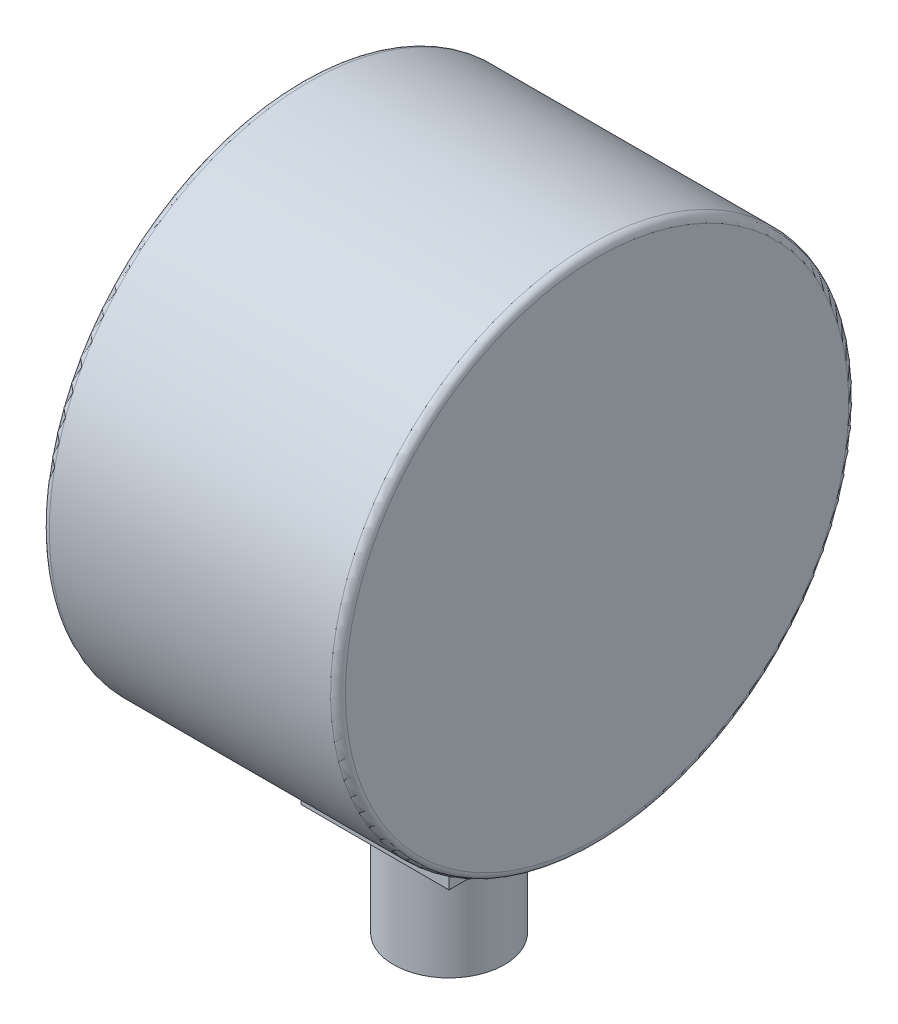
ISO-10303-21;
HEADER;
FILE_DESCRIPTION(('STEP AP214'),'2;1');
FILE_NAME('part.step','',(''),(''),'','','');
FILE_SCHEMA(('AUTOMOTIVE_DESIGN { 1 0 10303 214 1 1 1 1 }'));
ENDSEC;
DATA;
#1=APPLICATION_CONTEXT('core data for automotive mechanical design processes');
#2=APPLICATION_PROTOCOL_DEFINITION('international standard','automotive_design',2000,#1);
#3=PRODUCT_CONTEXT('',#1,'mechanical');
#4=PRODUCT('Part','Part','',(#3));
#5=PRODUCT_RELATED_PRODUCT_CATEGORY('part','',(#4));
#6=PRODUCT_DEFINITION_FORMATION('','',#4);
#7=PRODUCT_DEFINITION_CONTEXT('part definition',#1,'design');
#8=PRODUCT_DEFINITION('design','',#6,#7);
#9=PRODUCT_DEFINITION_SHAPE('','',#8);
#10=(LENGTH_UNIT() NAMED_UNIT(*) SI_UNIT(.MILLI.,.METRE.));
#11=(NAMED_UNIT(*) PLANE_ANGLE_UNIT() SI_UNIT($,.RADIAN.));
#12=(NAMED_UNIT(*) SI_UNIT($,.STERADIAN.) SOLID_ANGLE_UNIT());
#13=UNCERTAINTY_MEASURE_WITH_UNIT(LENGTH_MEASURE(1.E-05),#10,'distance_accuracy_value','');
#14=(GEOMETRIC_REPRESENTATION_CONTEXT(3) GLOBAL_UNCERTAINTY_ASSIGNED_CONTEXT((#13)) GLOBAL_UNIT_ASSIGNED_CONTEXT((#10,
#11,#12)) REPRESENTATION_CONTEXT('',''));
#15=CARTESIAN_POINT('',(0.,0.,0.));
#16=DIRECTION('',(0.,0.,1.));
#17=DIRECTION('',(1.,0.,0.));
#18=AXIS2_PLACEMENT_3D('',#15,#16,#17);
#19=CARTESIAN_POINT('',(0.,-69.85,0.));
#20=DIRECTION('',(0.,-1.,0.));
#21=DIRECTION('',(0.,0.,-1.));
#22=AXIS2_PLACEMENT_3D('',#19,#20,#21);
#23=PLANE('',#22);
#24=CARTESIAN_POINT('',(0.,-69.85,0.));
#25=DIRECTION('',(0.,-1.,0.));
#26=DIRECTION('',(0.,0.,-1.));
#27=AXIS2_PLACEMENT_3D('',#24,#25,#26);
#28=CIRCLE('',#27,9.525);
#29=CARTESIAN_POINT('',(0.,-69.85,-9.52500000000001));
#30=VERTEX_POINT('',#29);
#31=EDGE_CURVE('E285',#30,#30,#28,.F.);
#32=ORIENTED_EDGE('',*,*,#31,.F.);
#33=EDGE_LOOP('',(#32));
#34=FACE_BOUND('',#33,.T.);
#35=ADVANCED_FACE('F17',(#34),#23,.T.);
#36=CARTESIAN_POINT('',(0.,-50.8,0.));
#37=DIRECTION('',(0.,-1.,0.));
#38=DIRECTION('',(0.,0.,-1.));
#39=AXIS2_PLACEMENT_3D('',#36,#37,#38);
#40=CYLINDRICAL_SURFACE('',#39,9.525);
#41=ORIENTED_EDGE('',*,*,#31,.T.);
#42=EDGE_LOOP('',(#41));
#43=FACE_BOUND('',#42,.T.);
#44=CARTESIAN_POINT('',(0.,-50.8,0.));
#45=DIRECTION('',(0.,-1.,0.));
#46=DIRECTION('',(0.,0.,-1.));
#47=AXIS2_PLACEMENT_3D('',#44,#45,#46);
#48=CIRCLE('',#47,9.525);
#49=CARTESIAN_POINT('',(0.,-50.8,-9.52500000000001));
#50=VERTEX_POINT('',#49);
#51=EDGE_CURVE('E137',#50,#50,#48,.F.);
#52=ORIENTED_EDGE('',*,*,#51,.F.);
#53=EDGE_LOOP('',(#52));
#54=FACE_BOUND('',#53,.T.);
#55=ADVANCED_FACE('F706',(#43,#54),#40,.T.);
#56=CARTESIAN_POINT('',(0.,-50.8,0.));
#57=DIRECTION('',(0.,-1.,0.));
#58=DIRECTION('',(0.,0.,-1.));
#59=AXIS2_PLACEMENT_3D('',#56,#57,#58);
#60=PLANE('',#59);
#61=ORIENTED_EDGE('',*,*,#51,.T.);
#62=EDGE_LOOP('',(#61));
#63=FACE_BOUND('',#62,.T.);
#64=DIRECTION('',(0.,0.,-1.));
#65=VECTOR('',#64,1.);
#66=CARTESIAN_POINT('',(12.7,-50.8,-12.7));
#67=LINE('',#66,#65);
#68=CARTESIAN_POINT('',(12.7,-50.8,12.7));
#69=VERTEX_POINT('',#68);
#70=CARTESIAN_POINT('',(12.7,-50.8,-12.7));
#71=VERTEX_POINT('',#70);
#72=EDGE_CURVE('E226',#69,#71,#67,.T.);
#73=ORIENTED_EDGE('',*,*,#72,.F.);
#74=DIRECTION('',(1.,0.,0.));
#75=VECTOR('',#74,1.);
#76=CARTESIAN_POINT('',(12.7,-50.8,12.7));
#77=LINE('',#76,#75);
#78=CARTESIAN_POINT('',(-12.7,-50.8,12.7));
#79=VERTEX_POINT('',#78);
#80=EDGE_CURVE('E142',#79,#69,#77,.T.);
#81=ORIENTED_EDGE('',*,*,#80,.F.);
#82=DIRECTION('',(0.,0.,1.));
#83=VECTOR('',#82,1.);
#84=CARTESIAN_POINT('',(-12.7,-50.8,12.7));
#85=LINE('',#84,#83);
#86=CARTESIAN_POINT('',(-12.7,-50.8,-12.7));
#87=VERTEX_POINT('',#86);
#88=EDGE_CURVE('E140',#87,#79,#85,.T.);
#89=ORIENTED_EDGE('',*,*,#88,.F.);
#90=DIRECTION('',(-1.,0.,0.));
#91=VECTOR('',#90,1.);
#92=CARTESIAN_POINT('',(-12.7,-50.8,-12.7));
#93=LINE('',#92,#91);
#94=EDGE_CURVE('E128',#71,#87,#93,.T.);
#95=ORIENTED_EDGE('',*,*,#94,.F.);
#96=EDGE_LOOP('',(#73,#81,#89,#95));
#97=FACE_BOUND('',#96,.T.);
#98=ADVANCED_FACE('F141',(#63,#97),#60,.T.);
#99=CARTESIAN_POINT('',(25.4,22.225,0.));
#100=DIRECTION('',(1.,0.,0.));
#101=DIRECTION('',(0.,0.,-1.));
#102=AXIS2_PLACEMENT_3D('',#99,#100,#101);
#103=PLANE('',#102);
#104=CARTESIAN_POINT('',(25.4,0.,0.));
#105=DIRECTION('',(-1.,0.,0.));
#106=DIRECTION('',(0.,0.,1.));
#107=AXIS2_PLACEMENT_3D('',#104,#105,#106);
#108=CIRCLE('',#107,43.18);
#109=CARTESIAN_POINT('',(25.4,0.,43.18));
#110=VERTEX_POINT('',#109);
#111=CARTESIAN_POINT('',(25.4,43.18,0.));
#112=VERTEX_POINT('',#111);
#113=EDGE_CURVE('E476',#110,#112,#108,.T.);
#114=ORIENTED_EDGE('',*,*,#113,.F.);
#115=CARTESIAN_POINT('',(25.4,0.,0.));
#116=DIRECTION('',(-1.,0.,0.));
#117=DIRECTION('',(0.,0.,-1.));
#118=AXIS2_PLACEMENT_3D('',#115,#116,#117);
#119=CIRCLE('',#118,43.18);
#120=CARTESIAN_POINT('',(25.4,0.,-43.18));
#121=VERTEX_POINT('',#120);
#122=EDGE_CURVE('E187',#121,#110,#119,.T.);
#123=ORIENTED_EDGE('',*,*,#122,.F.);
#124=CARTESIAN_POINT('',(25.4,0.,0.));
#125=DIRECTION('',(-1.,0.,0.));
#126=DIRECTION('',(0.,1.,0.));
#127=AXIS2_PLACEMENT_3D('',#124,#125,#126);
#128=CIRCLE('',#127,43.18);
#129=EDGE_CURVE('E107',#112,#121,#128,.T.);
#130=ORIENTED_EDGE('',*,*,#129,.F.);
#131=EDGE_LOOP('',(#114,#123,#130));
#132=FACE_BOUND('',#131,.T.);
#133=ADVANCED_FACE('F165',(#132),#103,.T.);
#134=CARTESIAN_POINT('',(-12.7,-44.45,-12.7));
#135=DIRECTION('',(0.,0.,-1.));
#136=DIRECTION('',(-1.,0.,0.));
#137=AXIS2_PLACEMENT_3D('',#134,#135,#136);
#138=PLANE('',#137);
#139=ORIENTED_EDGE('',*,*,#94,.T.);
#140=DIRECTION('',(0.,1.,0.));
#141=VECTOR('',#140,1.);
#142=CARTESIAN_POINT('',(-12.7,-44.45,-12.7));
#143=LINE('',#142,#141);
#144=CARTESIAN_POINT('',(-12.7,-42.597094971371,-12.7));
#145=VERTEX_POINT('',#144);
#146=EDGE_CURVE('E132',#145,#87,#143,.F.);
#147=ORIENTED_EDGE('',*,*,#146,.F.);
#148=DIRECTION('',(1.,0.,0.));
#149=VECTOR('',#148,1.);
#150=CARTESIAN_POINT('',(0.,-42.597094971371,-12.7));
#151=LINE('',#150,#149);
#152=CARTESIAN_POINT('',(12.7,-42.597094971371,-12.7));
#153=VERTEX_POINT('',#152);
#154=EDGE_CURVE('E158',#153,#145,#151,.F.);
#155=ORIENTED_EDGE('',*,*,#154,.F.);
#156=DIRECTION('',(0.,1.,0.));
#157=VECTOR('',#156,1.);
#158=CARTESIAN_POINT('',(12.7,-44.45,-12.7));
#159=LINE('',#158,#157);
#160=EDGE_CURVE('E133',#71,#153,#159,.T.);
#161=ORIENTED_EDGE('',*,*,#160,.F.);
#162=EDGE_LOOP('',(#139,#147,#155,#161));
#163=FACE_BOUND('',#162,.T.);
#164=ADVANCED_FACE('F130',(#163),#138,.T.);
#165=CARTESIAN_POINT('',(-12.7,-44.45,12.7));
#166=DIRECTION('',(-1.,0.,0.));
#167=DIRECTION('',(0.,0.,1.));
#168=AXIS2_PLACEMENT_3D('',#165,#166,#167);
#169=PLANE('',#168);
#170=DIRECTION('',(0.,1.,0.));
#171=VECTOR('',#170,1.);
#172=CARTESIAN_POINT('',(-12.7,-44.45,12.7));
#173=LINE('',#172,#171);
#174=CARTESIAN_POINT('',(-12.7,-42.597094971371,12.7));
#175=VERTEX_POINT('',#174);
#176=EDGE_CURVE('E144',#175,#79,#173,.F.);
#177=ORIENTED_EDGE('',*,*,#176,.F.);
#178=CARTESIAN_POINT('',(-12.7,0.,0.));
#179=DIRECTION('',(1.,0.,0.));
#180=DIRECTION('',(0.,1.,0.));
#181=AXIS2_PLACEMENT_3D('',#178,#179,#180);
#182=CIRCLE('',#181,44.45);
#183=EDGE_CURVE('E90',#145,#175,#182,.F.);
#184=ORIENTED_EDGE('',*,*,#183,.F.);
#185=ORIENTED_EDGE('',*,*,#146,.T.);
#186=ORIENTED_EDGE('',*,*,#88,.T.);
#187=EDGE_LOOP('',(#177,#184,#185,#186));
#188=FACE_BOUND('',#187,.T.);
#189=ADVANCED_FACE('F146',(#188),#169,.T.);
#190=CARTESIAN_POINT('',(12.7,-44.45,12.7));
#191=DIRECTION('',(0.,0.,1.));
#192=DIRECTION('',(1.,0.,0.));
#193=AXIS2_PLACEMENT_3D('',#190,#191,#192);
#194=PLANE('',#193);
#195=ORIENTED_EDGE('',*,*,#80,.T.);
#196=DIRECTION('',(0.,1.,0.));
#197=VECTOR('',#196,1.);
#198=CARTESIAN_POINT('',(12.7,-44.45,12.7));
#199=LINE('',#198,#197);
#200=CARTESIAN_POINT('',(12.7,-42.597094971371,12.7));
#201=VERTEX_POINT('',#200);
#202=EDGE_CURVE('E229',#201,#69,#199,.F.);
#203=ORIENTED_EDGE('',*,*,#202,.F.);
#204=DIRECTION('',(1.,0.,0.));
#205=VECTOR('',#204,1.);
#206=CARTESIAN_POINT('',(0.,-42.597094971371,12.7));
#207=LINE('',#206,#205);
#208=EDGE_CURVE('E234',#175,#201,#207,.T.);
#209=ORIENTED_EDGE('',*,*,#208,.F.);
#210=ORIENTED_EDGE('',*,*,#176,.T.);
#211=EDGE_LOOP('',(#195,#203,#209,#210));
#212=FACE_BOUND('',#211,.T.);
#213=ADVANCED_FACE('F675',(#212),#194,.T.);
#214=CARTESIAN_POINT('',(12.7,-44.45,-12.7));
#215=DIRECTION('',(1.,0.,0.));
#216=DIRECTION('',(0.,0.,-1.));
#217=AXIS2_PLACEMENT_3D('',#214,#215,#216);
#218=PLANE('',#217);
#219=ORIENTED_EDGE('',*,*,#160,.T.);
#220=CARTESIAN_POINT('',(12.7,0.,0.));
#221=DIRECTION('',(1.,0.,0.));
#222=DIRECTION('',(0.,1.,0.));
#223=AXIS2_PLACEMENT_3D('',#220,#221,#222);
#224=CIRCLE('',#223,44.45);
#225=EDGE_CURVE('E98',#201,#153,#224,.T.);
#226=ORIENTED_EDGE('',*,*,#225,.F.);
#227=ORIENTED_EDGE('',*,*,#202,.T.);
#228=ORIENTED_EDGE('',*,*,#72,.T.);
#229=EDGE_LOOP('',(#219,#226,#227,#228));
#230=FACE_BOUND('',#229,.T.);
#231=ADVANCED_FACE('F214',(#230),#218,.T.);
#232=CARTESIAN_POINT('',(24.13,0.,0.));
#233=DIRECTION('',(1.,0.,0.));
#234=DIRECTION('',(0.,0.,-1.));
#235=AXIS2_PLACEMENT_3D('',#232,#233,#234);
#236=TOROIDAL_SURFACE('',#235,43.18,1.27);
#237=CARTESIAN_POINT('',(24.13,0.,0.));
#238=DIRECTION('',(1.,0.,0.));
#239=DIRECTION('',(0.,1.,0.));
#240=AXIS2_PLACEMENT_3D('',#237,#238,#239);
#241=CIRCLE('',#240,44.45);
#242=CARTESIAN_POINT('',(24.13,44.45,0.));
#243=VERTEX_POINT('',#242);
#244=EDGE_CURVE('E154',#243,#243,#241,.F.);
#245=ORIENTED_EDGE('',*,*,#244,.F.);
#246=EDGE_LOOP('',(#245));
#247=FACE_BOUND('',#246,.T.);
#248=ORIENTED_EDGE('',*,*,#113,.T.);
#249=ORIENTED_EDGE('',*,*,#129,.T.);
#250=ORIENTED_EDGE('',*,*,#122,.T.);
#251=EDGE_LOOP('',(#248,#249,#250));
#252=FACE_BOUND('',#251,.T.);
#253=ADVANCED_FACE('F202',(#247,#252),#236,.T.);
#254=CARTESIAN_POINT('',(-21.336,0.,0.));
#255=DIRECTION('',(-1.,0.,0.));
#256=DIRECTION('',(0.,0.,1.));
#257=AXIS2_PLACEMENT_3D('',#254,#255,#256);
#258=PLANE('',#257);
#259=CARTESIAN_POINT('',(-21.336,0.,0.));
#260=DIRECTION('',(-1.,0.,0.));
#261=DIRECTION('',(0.,-1.,0.));
#262=AXIS2_PLACEMENT_3D('',#259,#260,#261);
#263=CIRCLE('',#262,3.175);
#264=CARTESIAN_POINT('',(-21.336,-3.175,0.));
#265=VERTEX_POINT('',#264);
#266=EDGE_CURVE('E157',#265,#265,#263,.F.);
#267=ORIENTED_EDGE('',*,*,#266,.F.);
#268=EDGE_LOOP('',(#267));
#269=FACE_BOUND('',#268,.T.);
#270=ADVANCED_FACE('F213',(#269),#258,.T.);
#271=CARTESIAN_POINT('',(-24.13,0.,0.));
#272=DIRECTION('',(1.,0.,0.));
#273=DIRECTION('',(0.,1.,0.));
#274=AXIS2_PLACEMENT_3D('',#271,#272,#273);
#275=CYLINDRICAL_SURFACE('',#274,44.45);
#276=CARTESIAN_POINT('',(-24.13,0.,0.));
#277=DIRECTION('',(1.,0.,0.));
#278=DIRECTION('',(0.,0.,-1.));
#279=AXIS2_PLACEMENT_3D('',#276,#277,#278);
#280=CIRCLE('',#279,44.45);
#281=CARTESIAN_POINT('',(-24.13,0.,-44.45));
#282=VERTEX_POINT('',#281);
#283=EDGE_CURVE('E223',#282,#282,#280,.F.);
#284=ORIENTED_EDGE('',*,*,#283,.F.);
#285=EDGE_LOOP('',(#284));
#286=FACE_BOUND('',#285,.T.);
#287=ORIENTED_EDGE('',*,*,#154,.T.);
#288=ORIENTED_EDGE('',*,*,#183,.T.);
#289=ORIENTED_EDGE('',*,*,#208,.T.);
#290=ORIENTED_EDGE('',*,*,#225,.T.);
#291=EDGE_LOOP('',(#287,#288,#289,#290));
#292=FACE_BOUND('',#291,.T.);
#293=ORIENTED_EDGE('',*,*,#244,.T.);
#294=EDGE_LOOP('',(#293));
#295=FACE_BOUND('',#294,.T.);
#296=ADVANCED_FACE('F648',(#286,#292,#295),#275,.T.);
#297=CARTESIAN_POINT('',(-19.558,0.,0.));
#298=DIRECTION('',(-1.,0.,0.));
#299=DIRECTION('',(0.,-1.,0.));
#300=AXIS2_PLACEMENT_3D('',#297,#298,#299);
#301=CYLINDRICAL_SURFACE('',#300,3.175);
#302=ORIENTED_EDGE('',*,*,#266,.T.);
#303=EDGE_LOOP('',(#302));
#304=FACE_BOUND('',#303,.T.);
#305=CARTESIAN_POINT('',(-19.558,0.,0.));
#306=DIRECTION('',(-1.,0.,0.));
#307=DIRECTION('',(0.,-1.,0.));
#308=AXIS2_PLACEMENT_3D('',#305,#306,#307);
#309=CIRCLE('',#308,3.175);
#310=CARTESIAN_POINT('',(-19.558,-3.175,0.));
#311=VERTEX_POINT('',#310);
#312=EDGE_CURVE('E275',#311,#311,#309,.F.);
#313=ORIENTED_EDGE('',*,*,#312,.F.);
#314=EDGE_LOOP('',(#313));
#315=FACE_BOUND('',#314,.T.);
#316=ADVANCED_FACE('F450',(#304,#315),#301,.T.);
#317=CARTESIAN_POINT('',(-24.13,0.,0.));
#318=DIRECTION('',(1.,0.,0.));
#319=DIRECTION('',(0.,0.,-1.));
#320=AXIS2_PLACEMENT_3D('',#317,#318,#319);
#321=TOROIDAL_SURFACE('',#320,43.18,1.27);
#322=ORIENTED_EDGE('',*,*,#283,.T.);
#323=EDGE_LOOP('',(#322));
#324=FACE_BOUND('',#323,.T.);
#325=CARTESIAN_POINT('',(-25.4,0.,0.));
#326=DIRECTION('',(1.,0.,0.));
#327=DIRECTION('',(0.,0.,1.));
#328=AXIS2_PLACEMENT_3D('',#325,#326,#327);
#329=CIRCLE('',#328,43.18);
#330=CARTESIAN_POINT('',(-25.4,0.,-43.18));
#331=VERTEX_POINT('',#330);
#332=CARTESIAN_POINT('',(-25.4,0.,43.18));
#333=VERTEX_POINT('',#332);
#334=EDGE_CURVE('E430',#331,#333,#329,.F.);
#335=ORIENTED_EDGE('',*,*,#334,.F.);
#336=CARTESIAN_POINT('',(-25.4,0.,0.));
#337=DIRECTION('',(1.,0.,0.));
#338=DIRECTION('',(0.,0.,-1.));
#339=AXIS2_PLACEMENT_3D('',#336,#337,#338);
#340=CIRCLE('',#339,43.18);
#341=CARTESIAN_POINT('',(-25.4,43.18,0.));
#342=VERTEX_POINT('',#341);
#343=EDGE_CURVE('E477',#342,#331,#340,.F.);
#344=ORIENTED_EDGE('',*,*,#343,.F.);
#345=CARTESIAN_POINT('',(-25.4,0.,0.));
#346=DIRECTION('',(1.,0.,0.));
#347=DIRECTION('',(0.,1.,0.));
#348=AXIS2_PLACEMENT_3D('',#345,#346,#347);
#349=CIRCLE('',#348,43.18);
#350=EDGE_CURVE('E278',#333,#342,#349,.F.);
#351=ORIENTED_EDGE('',*,*,#350,.F.);
#352=EDGE_LOOP('',(#335,#344,#351));
#353=FACE_BOUND('',#352,.T.);
#354=ADVANCED_FACE('F446',(#324,#353),#321,.T.);
#355=CARTESIAN_POINT('',(-19.558,0.,0.));
#356=DIRECTION('',(-1.,0.,0.));
#357=DIRECTION('',(0.,0.,1.));
#358=AXIS2_PLACEMENT_3D('',#355,#356,#357);
#359=PLANE('',#358);
#360=ORIENTED_EDGE('',*,*,#312,.T.);
#361=EDGE_LOOP('',(#360));
#362=FACE_BOUND('',#361,.T.);
#363=DIRECTION('',(0.,-0.789496533939686,-0.613755018633023));
#364=VECTOR('',#363,1.);
#365=CARTESIAN_POINT('',(-19.558,13.7837412582907,13.527438853105));
#366=LINE('',#365,#364);
#367=CARTESIAN_POINT('',(-19.558,-4.68903090902375,-0.833303896678692));
#368=VERTEX_POINT('',#367);
#369=CARTESIAN_POINT('',(-19.558,-26.3978118430074,-17.709721555094));
#370=VERTEX_POINT('',#369);
#371=EDGE_CURVE('E270',#368,#370,#366,.T.);
#372=ORIENTED_EDGE('',*,*,#371,.F.);
#373=CARTESIAN_POINT('',(-19.558,0.,0.));
#374=DIRECTION('',(-1.,0.,0.));
#375=DIRECTION('',(0.,-1.,0.));
#376=AXIS2_PLACEMENT_3D('',#373,#374,#375);
#377=CIRCLE('',#376,4.7625);
#378=CARTESIAN_POINT('',(-19.558,1.96392706112732,4.33870911084989));
#379=VERTEX_POINT('',#378);
#380=EDGE_CURVE('E271',#379,#368,#377,.F.);
#381=ORIENTED_EDGE('',*,*,#380,.F.);
#382=DIRECTION('',(0.,-0.789496533939686,-0.613755018633023));
#383=VECTOR('',#382,1.);
#384=CARTESIAN_POINT('',(-19.558,13.7837412582907,13.527438853105));
#385=LINE('',#384,#383);
#386=CARTESIAN_POINT('',(-19.558,13.7837412582907,13.527438853105));
#387=VERTEX_POINT('',#386);
#388=EDGE_CURVE('E336',#387,#379,#385,.T.);
#389=ORIENTED_EDGE('',*,*,#388,.F.);
#390=DIRECTION('',(0.,-0.573576436351046,0.819152044288992));
#391=VECTOR('',#390,1.);
#392=CARTESIAN_POINT('',(-19.558,17.4259516291199,8.32582337186989));
#393=LINE('',#392,#391);
#394=CARTESIAN_POINT('',(-19.558,17.4259516291199,8.32582337186988));
#395=VERTEX_POINT('',#394);
#396=EDGE_CURVE('E351',#395,#387,#393,.T.);
#397=ORIENTED_EDGE('',*,*,#396,.F.);
#398=DIRECTION('',(0.,0.84676477967294,0.531967487639459));
#399=VECTOR('',#398,1.);
#400=CARTESIAN_POINT('',(-19.558,-25.6702780515244,-18.748747489238));
#401=LINE('',#400,#399);
#402=CARTESIAN_POINT('',(-19.558,4.74875555013016,0.361561855161811));
#403=VERTEX_POINT('',#402);
#404=EDGE_CURVE('E422',#403,#395,#401,.T.);
#405=ORIENTED_EDGE('',*,*,#404,.F.);
#406=CARTESIAN_POINT('',(-19.558,0.,0.));
#407=DIRECTION('',(-1.,0.,0.));
#408=DIRECTION('',(0.,-1.,0.));
#409=AXIS2_PLACEMENT_3D('',#406,#407,#408);
#410=CIRCLE('',#409,4.7625);
#411=CARTESIAN_POINT('',(-19.558,-2.38679254614389,-4.12124102567078));
#412=VERTEX_POINT('',#411);
#413=EDGE_CURVE('E263',#412,#403,#410,.F.);
#414=ORIENTED_EDGE('',*,*,#413,.F.);
#415=DIRECTION('',(0.,0.84676477967294,0.531967487639459));
#416=VECTOR('',#415,1.);
#417=CARTESIAN_POINT('',(-19.558,-25.6702780515244,-18.748747489238));
#418=LINE('',#417,#416);
#419=CARTESIAN_POINT('',(-19.558,-25.6702780515244,-18.748747489238));
#420=VERTEX_POINT('',#419);
#421=EDGE_CURVE('E326',#420,#412,#418,.T.);
#422=ORIENTED_EDGE('',*,*,#421,.F.);
#423=CARTESIAN_POINT('',(-19.558,-26.0080774061755,-18.2110518541457));
#424=DIRECTION('',(-1.,0.,0.));
#425=DIRECTION('',(0.,0.,1.));
#426=AXIS2_PLACEMENT_3D('',#423,#424,#425);
#427=CIRCLE('',#426,0.634999999999999);
#428=EDGE_CURVE('E267',#370,#420,#427,.F.);
#429=ORIENTED_EDGE('',*,*,#428,.F.);
#430=EDGE_LOOP('',(#372,#381,#389,#397,#405,#414,#422,#429));
#431=FACE_BOUND('',#430,.T.);
#432=ADVANCED_FACE('F377',(#362,#431),#359,.T.);
#433=CARTESIAN_POINT('',(-25.4,41.91,0.));
#434=DIRECTION('',(-1.,0.,0.));
#435=DIRECTION('',(0.,0.,1.));
#436=AXIS2_PLACEMENT_3D('',#433,#434,#435);
#437=PLANE('',#436);
#438=CARTESIAN_POINT('',(-25.4,0.,0.));
#439=DIRECTION('',(-1.,0.,0.));
#440=DIRECTION('',(0.,0.,1.));
#441=AXIS2_PLACEMENT_3D('',#438,#439,#440);
#442=CIRCLE('',#441,40.64);
#443=CARTESIAN_POINT('',(-25.4,0.,40.64));
#444=VERTEX_POINT('',#443);
#445=CARTESIAN_POINT('',(-25.4,40.64,0.));
#446=VERTEX_POINT('',#445);
#447=EDGE_CURVE('E294',#444,#446,#442,.T.);
#448=ORIENTED_EDGE('',*,*,#447,.F.);
#449=CARTESIAN_POINT('',(-25.4,0.,0.));
#450=DIRECTION('',(-1.,0.,0.));
#451=DIRECTION('',(0.,0.,-1.));
#452=AXIS2_PLACEMENT_3D('',#449,#450,#451);
#453=CIRCLE('',#452,40.64);
#454=CARTESIAN_POINT('',(-25.4,0.,-40.64));
#455=VERTEX_POINT('',#454);
#456=EDGE_CURVE('E410',#455,#444,#453,.T.);
#457=ORIENTED_EDGE('',*,*,#456,.F.);
#458=CARTESIAN_POINT('',(-25.4,0.,0.));
#459=DIRECTION('',(-1.,0.,0.));
#460=DIRECTION('',(0.,1.,0.));
#461=AXIS2_PLACEMENT_3D('',#458,#459,#460);
#462=CIRCLE('',#461,40.64);
#463=EDGE_CURVE('E490',#446,#455,#462,.T.);
#464=ORIENTED_EDGE('',*,*,#463,.F.);
#465=EDGE_LOOP('',(#448,#457,#464));
#466=FACE_BOUND('',#465,.T.);
#467=ORIENTED_EDGE('',*,*,#343,.T.);
#468=ORIENTED_EDGE('',*,*,#334,.T.);
#469=ORIENTED_EDGE('',*,*,#350,.T.);
#470=EDGE_LOOP('',(#467,#468,#469));
#471=FACE_BOUND('',#470,.T.);
#472=ADVANCED_FACE('F366',(#466,#471),#437,.T.);
#473=CARTESIAN_POINT('',(-19.05,-25.6702780515244,-18.748747489238));
#474=DIRECTION('',(0.,0.531967487639459,-0.84676477967294));
#475=DIRECTION('',(0.,0.84676477967294,0.531967487639459));
#476=AXIS2_PLACEMENT_3D('',#473,#474,#475);
#477=PLANE('',#476);
#478=DIRECTION('',(1.,0.,0.));
#479=VECTOR('',#478,1.);
#480=CARTESIAN_POINT('',(-19.05,17.4259516291199,8.32582337186989));
#481=LINE('',#480,#479);
#482=CARTESIAN_POINT('',(-19.05,17.4259516291199,8.32582337186989));
#483=VERTEX_POINT('',#482);
#484=EDGE_CURVE('E340',#483,#395,#481,.F.);
#485=ORIENTED_EDGE('',*,*,#484,.F.);
#486=DIRECTION('',(0.,0.846764779672939,0.531967487639459));
#487=VECTOR('',#486,1.);
#488=CARTESIAN_POINT('',(-19.05,4.74875555013015,0.361561855161836));
#489=LINE('',#488,#487);
#490=CARTESIAN_POINT('',(-19.05,4.74875555013016,0.361561855161836));
#491=VERTEX_POINT('',#490);
#492=EDGE_CURVE('E346',#491,#483,#489,.T.);
#493=ORIENTED_EDGE('',*,*,#492,.F.);
#494=DIRECTION('',(-1.,0.,0.));
#495=VECTOR('',#494,1.);
#496=CARTESIAN_POINT('',(-19.05,4.74875555013016,0.361561855161834));
#497=LINE('',#496,#495);
#498=EDGE_CURVE('E266',#403,#491,#497,.F.);
#499=ORIENTED_EDGE('',*,*,#498,.F.);
#500=ORIENTED_EDGE('',*,*,#404,.T.);
#501=EDGE_LOOP('',(#485,#493,#499,#500));
#502=FACE_BOUND('',#501,.T.);
#503=ADVANCED_FACE('F376',(#502),#477,.T.);
#504=CARTESIAN_POINT('',(-19.05,17.4259516291199,8.32582337186989));
#505=DIRECTION('',(0.,0.819152044288992,0.573576436351046));
#506=DIRECTION('',(0.,-0.573576436351046,0.819152044288992));
#507=AXIS2_PLACEMENT_3D('',#504,#505,#506);
#508=PLANE('',#507);
#509=DIRECTION('',(0.,-0.573576436351047,0.819152044288991));
#510=VECTOR('',#509,1.);
#511=CARTESIAN_POINT('',(-19.05,17.4259516291199,8.32582337186989));
#512=LINE('',#511,#510);
#513=CARTESIAN_POINT('',(-19.05,13.7837412582907,13.527438853105));
#514=VERTEX_POINT('',#513);
#515=EDGE_CURVE('E343',#483,#514,#512,.T.);
#516=ORIENTED_EDGE('',*,*,#515,.F.);
#517=ORIENTED_EDGE('',*,*,#484,.T.);
#518=ORIENTED_EDGE('',*,*,#396,.T.);
#519=DIRECTION('',(1.,0.,0.));
#520=VECTOR('',#519,1.);
#521=CARTESIAN_POINT('',(-19.05,13.7837412582907,13.527438853105));
#522=LINE('',#521,#520);
#523=EDGE_CURVE('E337',#514,#387,#522,.F.);
#524=ORIENTED_EDGE('',*,*,#523,.F.);
#525=EDGE_LOOP('',(#516,#517,#518,#524));
#526=FACE_BOUND('',#525,.T.);
#527=ADVANCED_FACE('F516',(#526),#508,.T.);
#528=CARTESIAN_POINT('',(-19.05,13.7837412582907,13.527438853105));
#529=DIRECTION('',(0.,-0.613755018633023,0.789496533939686));
#530=DIRECTION('',(0.,-0.789496533939686,-0.613755018633023));
#531=AXIS2_PLACEMENT_3D('',#528,#529,#530);
#532=PLANE('',#531);
#533=ORIENTED_EDGE('',*,*,#523,.T.);
#534=ORIENTED_EDGE('',*,*,#388,.T.);
#535=DIRECTION('',(-1.,0.,0.));
#536=VECTOR('',#535,1.);
#537=CARTESIAN_POINT('',(-19.05,1.96392706112732,4.33870911084989));
#538=LINE('',#537,#536);
#539=CARTESIAN_POINT('',(-19.05,1.96392706112732,4.33870911084989));
#540=VERTEX_POINT('',#539);
#541=EDGE_CURVE('E274',#540,#379,#538,.T.);
#542=ORIENTED_EDGE('',*,*,#541,.F.);
#543=DIRECTION('',(0.,-0.789496533939685,-0.613755018633023));
#544=VECTOR('',#543,1.);
#545=CARTESIAN_POINT('',(-19.05,13.7837412582907,13.527438853105));
#546=LINE('',#545,#544);
#547=EDGE_CURVE('E262',#514,#540,#546,.T.);
#548=ORIENTED_EDGE('',*,*,#547,.F.);
#549=EDGE_LOOP('',(#533,#534,#542,#548));
#550=FACE_BOUND('',#549,.T.);
#551=ADVANCED_FACE('F520',(#550),#532,.T.);
#552=CARTESIAN_POINT('',(-19.05,0.,0.));
#553=DIRECTION('',(-1.,0.,0.));
#554=DIRECTION('',(0.,-1.,0.));
#555=AXIS2_PLACEMENT_3D('',#552,#553,#554);
#556=CYLINDRICAL_SURFACE('',#555,4.7625);
#557=ORIENTED_EDGE('',*,*,#541,.T.);
#558=ORIENTED_EDGE('',*,*,#380,.T.);
#559=DIRECTION('',(1.,0.,0.));
#560=VECTOR('',#559,1.);
#561=CARTESIAN_POINT('',(-19.05,-4.68903090902376,-0.833303896678692));
#562=LINE('',#561,#560);
#563=CARTESIAN_POINT('',(-19.05,-4.68903090902375,-0.8333038966787));
#564=VERTEX_POINT('',#563);
#565=EDGE_CURVE('E273',#564,#368,#562,.F.);
#566=ORIENTED_EDGE('',*,*,#565,.F.);
#567=CARTESIAN_POINT('',(-19.05,0.,0.));
#568=DIRECTION('',(-1.,0.,0.));
#569=DIRECTION('',(0.,-1.,0.));
#570=AXIS2_PLACEMENT_3D('',#567,#568,#569);
#571=CIRCLE('',#570,4.7625);
#572=EDGE_CURVE('E259',#540,#564,#571,.F.);
#573=ORIENTED_EDGE('',*,*,#572,.F.);
#574=EDGE_LOOP('',(#557,#558,#566,#573));
#575=FACE_BOUND('',#574,.T.);
#576=ADVANCED_FACE('F524',(#575),#556,.T.);
#577=CARTESIAN_POINT('',(-19.05,13.7837412582907,13.527438853105));
#578=DIRECTION('',(0.,-0.613755018633023,0.789496533939686));
#579=DIRECTION('',(0.,-0.789496533939686,-0.613755018633023));
#580=AXIS2_PLACEMENT_3D('',#577,#578,#579);
#581=PLANE('',#580);
#582=DIRECTION('',(-1.,0.,0.));
#583=VECTOR('',#582,1.);
#584=CARTESIAN_POINT('',(-19.05,-26.3978118430074,-17.709721555094));
#585=LINE('',#584,#583);
#586=CARTESIAN_POINT('',(-19.05,-26.3978118430074,-17.709721555094));
#587=VERTEX_POINT('',#586);
#588=EDGE_CURVE('E269',#587,#370,#585,.T.);
#589=ORIENTED_EDGE('',*,*,#588,.F.);
#590=DIRECTION('',(0.,-0.789496533939684,-0.613755018633026));
#591=VECTOR('',#590,1.);
#592=CARTESIAN_POINT('',(-19.05,-4.68903090902375,-0.833303896678706));
#593=LINE('',#592,#591);
#594=EDGE_CURVE('E258',#564,#587,#593,.T.);
#595=ORIENTED_EDGE('',*,*,#594,.F.);
#596=ORIENTED_EDGE('',*,*,#565,.T.);
#597=ORIENTED_EDGE('',*,*,#371,.T.);
#598=EDGE_LOOP('',(#589,#595,#596,#597));
#599=FACE_BOUND('',#598,.T.);
#600=ADVANCED_FACE('F527',(#599),#581,.T.);
#601=CARTESIAN_POINT('',(-19.05,-26.0080774061755,-18.2110518541457));
#602=DIRECTION('',(-1.,0.,0.));
#603=DIRECTION('',(0.,0.,1.));
#604=AXIS2_PLACEMENT_3D('',#601,#602,#603);
#605=CYLINDRICAL_SURFACE('',#604,0.634999999999999);
#606=CARTESIAN_POINT('',(-19.05,-26.0080774061755,-18.2110518541457));
#607=DIRECTION('',(-1.,0.,0.));
#608=DIRECTION('',(0.,0.,1.));
#609=AXIS2_PLACEMENT_3D('',#606,#607,#608);
#610=CIRCLE('',#609,0.634999999999999);
#611=CARTESIAN_POINT('',(-19.05,-25.6702780515244,-18.748747489238));
#612=VERTEX_POINT('',#611);
#613=EDGE_CURVE('E255',#587,#612,#610,.F.);
#614=ORIENTED_EDGE('',*,*,#613,.F.);
#615=ORIENTED_EDGE('',*,*,#588,.T.);
#616=ORIENTED_EDGE('',*,*,#428,.T.);
#617=DIRECTION('',(1.,0.,0.));
#618=VECTOR('',#617,1.);
#619=CARTESIAN_POINT('',(-19.05,-25.6702780515244,-18.748747489238));
#620=LINE('',#619,#618);
#621=EDGE_CURVE('E327',#612,#420,#620,.F.);
#622=ORIENTED_EDGE('',*,*,#621,.F.);
#623=EDGE_LOOP('',(#614,#615,#616,#622));
#624=FACE_BOUND('',#623,.T.);
#625=ADVANCED_FACE('F508',(#624),#605,.T.);
#626=CARTESIAN_POINT('',(-19.05,-25.6702780515244,-18.748747489238));
#627=DIRECTION('',(0.,0.531967487639459,-0.84676477967294));
#628=DIRECTION('',(0.,0.84676477967294,0.531967487639459));
#629=AXIS2_PLACEMENT_3D('',#626,#627,#628);
#630=PLANE('',#629);
#631=ORIENTED_EDGE('',*,*,#621,.T.);
#632=ORIENTED_EDGE('',*,*,#421,.T.);
#633=DIRECTION('',(-1.,0.,0.));
#634=VECTOR('',#633,1.);
#635=CARTESIAN_POINT('',(-19.05,-2.38679254614391,-4.12124102567077));
#636=LINE('',#635,#634);
#637=CARTESIAN_POINT('',(-19.05,-2.38679254614391,-4.12124102567077));
#638=VERTEX_POINT('',#637);
#639=EDGE_CURVE('E37',#638,#412,#636,.T.);
#640=ORIENTED_EDGE('',*,*,#639,.F.);
#641=DIRECTION('',(0.,0.846764779672939,0.53196748763946));
#642=VECTOR('',#641,1.);
#643=CARTESIAN_POINT('',(-19.05,-25.6702780515244,-18.748747489238));
#644=LINE('',#643,#642);
#645=EDGE_CURVE('E254',#612,#638,#644,.T.);
#646=ORIENTED_EDGE('',*,*,#645,.F.);
#647=EDGE_LOOP('',(#631,#632,#640,#646));
#648=FACE_BOUND('',#647,.T.);
#649=ADVANCED_FACE('F504',(#648),#630,.T.);
#650=CARTESIAN_POINT('',(-19.05,0.,0.));
#651=DIRECTION('',(-1.,0.,0.));
#652=DIRECTION('',(0.,-1.,0.));
#653=AXIS2_PLACEMENT_3D('',#650,#651,#652);
#654=CYLINDRICAL_SURFACE('',#653,4.7625);
#655=ORIENTED_EDGE('',*,*,#498,.T.);
#656=CARTESIAN_POINT('',(-19.05,0.,0.));
#657=DIRECTION('',(-1.,0.,0.));
#658=DIRECTION('',(0.,-1.,0.));
#659=AXIS2_PLACEMENT_3D('',#656,#657,#658);
#660=CIRCLE('',#659,4.7625);
#661=EDGE_CURVE('E251',#638,#491,#660,.F.);
#662=ORIENTED_EDGE('',*,*,#661,.F.);
#663=ORIENTED_EDGE('',*,*,#639,.T.);
#664=ORIENTED_EDGE('',*,*,#413,.T.);
#665=EDGE_LOOP('',(#655,#662,#663,#664));
#666=FACE_BOUND('',#665,.T.);
#667=ADVANCED_FACE('F312',(#666),#654,.T.);
#668=CARTESIAN_POINT('',(-24.13,0.,0.));
#669=DIRECTION('',(1.,0.,0.));
#670=DIRECTION('',(0.,0.,-1.));
#671=AXIS2_PLACEMENT_3D('',#668,#669,#670);
#672=TOROIDAL_SURFACE('',#671,40.64,1.27);
#673=ORIENTED_EDGE('',*,*,#463,.T.);
#674=ORIENTED_EDGE('',*,*,#456,.T.);
#675=ORIENTED_EDGE('',*,*,#447,.T.);
#676=EDGE_LOOP('',(#673,#674,#675));
#677=FACE_BOUND('',#676,.T.);
#678=CARTESIAN_POINT('',(-24.13,0.,0.));
#679=DIRECTION('',(1.,0.,0.));
#680=DIRECTION('',(0.,1.,0.));
#681=AXIS2_PLACEMENT_3D('',#678,#679,#680);
#682=CIRCLE('',#681,39.37);
#683=CARTESIAN_POINT('',(-24.13,39.37,0.));
#684=VERTEX_POINT('',#683);
#685=EDGE_CURVE('E248',#684,#684,#682,.F.);
#686=ORIENTED_EDGE('',*,*,#685,.F.);
#687=EDGE_LOOP('',(#686));
#688=FACE_BOUND('',#687,.T.);
#689=ADVANCED_FACE('F300',(#677,#688),#672,.T.);
#690=CARTESIAN_POINT('',(-19.05,20.6375,0.));
#691=DIRECTION('',(-1.,0.,0.));
#692=DIRECTION('',(0.,0.,1.));
#693=AXIS2_PLACEMENT_3D('',#690,#691,#692);
#694=PLANE('',#693);
#695=ORIENTED_EDGE('',*,*,#645,.T.);
#696=ORIENTED_EDGE('',*,*,#661,.T.);
#697=ORIENTED_EDGE('',*,*,#492,.T.);
#698=ORIENTED_EDGE('',*,*,#515,.T.);
#699=ORIENTED_EDGE('',*,*,#547,.T.);
#700=ORIENTED_EDGE('',*,*,#572,.T.);
#701=ORIENTED_EDGE('',*,*,#594,.T.);
#702=ORIENTED_EDGE('',*,*,#613,.T.);
#703=EDGE_LOOP('',(#695,#696,#697,#698,#699,#700,#701,#702));
#704=FACE_BOUND('',#703,.T.);
#705=CARTESIAN_POINT('',(-19.05,0.,0.));
#706=DIRECTION('',(1.,0.,0.));
#707=DIRECTION('',(0.,0.,-1.));
#708=AXIS2_PLACEMENT_3D('',#705,#706,#707);
#709=CIRCLE('',#708,41.275);
#710=CARTESIAN_POINT('',(-19.05,0.,-41.275));
#711=VERTEX_POINT('',#710);
#712=EDGE_CURVE('E28',#711,#711,#709,.T.);
#713=ORIENTED_EDGE('',*,*,#712,.F.);
#714=EDGE_LOOP('',(#713));
#715=FACE_BOUND('',#714,.T.);
#716=ADVANCED_FACE('F311',(#704,#715),#694,.T.);
#717=CARTESIAN_POINT('',(-24.13,40.3225,0.));
#718=DIRECTION('',(1.,0.,0.));
#719=DIRECTION('',(0.,0.,-1.));
#720=AXIS2_PLACEMENT_3D('',#717,#718,#719);
#721=PLANE('',#720);
#722=ORIENTED_EDGE('',*,*,#685,.T.);
#723=EDGE_LOOP('',(#722));
#724=FACE_BOUND('',#723,.T.);
#725=CARTESIAN_POINT('',(-24.13,0.,0.));
#726=DIRECTION('',(1.,0.,0.));
#727=DIRECTION('',(0.,0.,-1.));
#728=AXIS2_PLACEMENT_3D('',#725,#726,#727);
#729=CIRCLE('',#728,41.275);
#730=CARTESIAN_POINT('',(-24.13,0.,-41.275));
#731=VERTEX_POINT('',#730);
#732=EDGE_CURVE('E11',#731,#731,#729,.F.);
#733=ORIENTED_EDGE('',*,*,#732,.F.);
#734=EDGE_LOOP('',(#733));
#735=FACE_BOUND('',#734,.T.);
#736=ADVANCED_FACE('F539',(#724,#735),#721,.T.);
#737=CARTESIAN_POINT('',(-24.13,0.,0.));
#738=DIRECTION('',(1.,0.,0.));
#739=DIRECTION('',(0.,0.,-1.));
#740=AXIS2_PLACEMENT_3D('',#737,#738,#739);
#741=CYLINDRICAL_SURFACE('',#740,41.275);
#742=ORIENTED_EDGE('',*,*,#712,.T.);
#743=EDGE_LOOP('',(#742));
#744=FACE_BOUND('',#743,.T.);
#745=ORIENTED_EDGE('',*,*,#732,.T.);
#746=EDGE_LOOP('',(#745));
#747=FACE_BOUND('',#746,.T.);
#748=ADVANCED_FACE('F537',(#744,#747),#741,.F.);
#749=CLOSED_SHELL('',(#35,#55,#98,#133,#164,#189,#213,#231,#253,#270,#296,#316,#354,#432,#472,
#503,#527,#551,#576,#600,#625,#649,#667,#689,#716,#736,#748));
#750=MANIFOLD_SOLID_BREP('B1',#749);
#751=ADVANCED_BREP_SHAPE_REPRESENTATION('',(#18,#750),#14);
#752=SHAPE_DEFINITION_REPRESENTATION(#9,#751);
ENDSEC;
END-ISO-10303-21;
